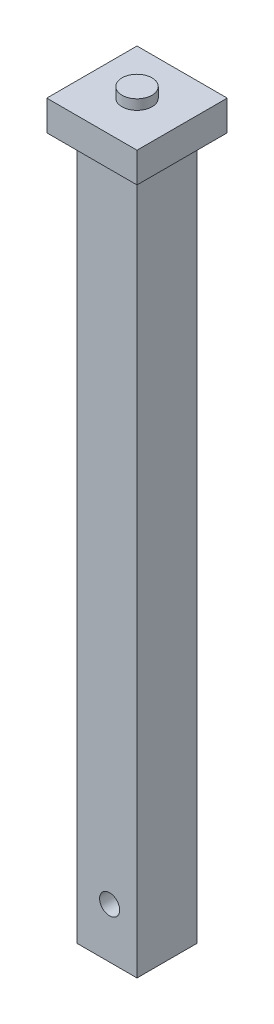
ISO-10303-21;
HEADER;
FILE_DESCRIPTION(('STEP AP214'),'2;1');
FILE_NAME('part.step','',(''),(''),'','','');
FILE_SCHEMA(('AUTOMOTIVE_DESIGN { 1 0 10303 214 1 1 1 1 }'));
ENDSEC;
DATA;
#1=APPLICATION_CONTEXT('core data for automotive mechanical design processes');
#2=APPLICATION_PROTOCOL_DEFINITION('international standard','automotive_design',2000,#1);
#3=PRODUCT_CONTEXT('',#1,'mechanical');
#4=PRODUCT('Part','Part','',(#3));
#5=PRODUCT_RELATED_PRODUCT_CATEGORY('part','',(#4));
#6=PRODUCT_DEFINITION_FORMATION('','',#4);
#7=PRODUCT_DEFINITION_CONTEXT('part definition',#1,'design');
#8=PRODUCT_DEFINITION('design','',#6,#7);
#9=PRODUCT_DEFINITION_SHAPE('','',#8);
#10=(LENGTH_UNIT() NAMED_UNIT(*) SI_UNIT(.MILLI.,.METRE.));
#11=(NAMED_UNIT(*) PLANE_ANGLE_UNIT() SI_UNIT($,.RADIAN.));
#12=(NAMED_UNIT(*) SI_UNIT($,.STERADIAN.) SOLID_ANGLE_UNIT());
#13=UNCERTAINTY_MEASURE_WITH_UNIT(LENGTH_MEASURE(1.E-05),#10,'distance_accuracy_value','');
#14=(GEOMETRIC_REPRESENTATION_CONTEXT(3) GLOBAL_UNCERTAINTY_ASSIGNED_CONTEXT((#13)) GLOBAL_UNIT_ASSIGNED_CONTEXT((#10,
#11,#12)) REPRESENTATION_CONTEXT('',''));
#15=CARTESIAN_POINT('',(0.,0.,0.));
#16=DIRECTION('',(0.,0.,1.));
#17=DIRECTION('',(1.,0.,0.));
#18=AXIS2_PLACEMENT_3D('',#15,#16,#17);
#19=CARTESIAN_POINT('',(0.,0.,0.));
#20=DIRECTION('',(0.,1.,0.));
#21=DIRECTION('',(0.,0.,1.));
#22=AXIS2_PLACEMENT_3D('',#19,#20,#21);
#23=PLANE('',#22);
#24=DIRECTION('',(0.,0.,-1.));
#25=VECTOR('',#24,1.);
#26=CARTESIAN_POINT('',(45.,0.,-45.));
#27=LINE('',#26,#25);
#28=CARTESIAN_POINT('',(45.,0.,45.));
#29=VERTEX_POINT('',#28);
#30=CARTESIAN_POINT('',(45.,0.,-45.));
#31=VERTEX_POINT('',#30);
#32=EDGE_CURVE('E132',#29,#31,#27,.T.);
#33=ORIENTED_EDGE('',*,*,#32,.F.);
#34=DIRECTION('',(1.,0.,0.));
#35=VECTOR('',#34,1.);
#36=CARTESIAN_POINT('',(-45.,0.,45.));
#37=LINE('',#36,#35);
#38=CARTESIAN_POINT('',(-45.,0.,45.));
#39=VERTEX_POINT('',#38);
#40=EDGE_CURVE('E150',#39,#29,#37,.T.);
#41=ORIENTED_EDGE('',*,*,#40,.F.);
#42=DIRECTION('',(0.,0.,1.));
#43=VECTOR('',#42,1.);
#44=CARTESIAN_POINT('',(-45.,0.,-45.));
#45=LINE('',#44,#43);
#46=CARTESIAN_POINT('',(-45.,0.,-45.));
#47=VERTEX_POINT('',#46);
#48=EDGE_CURVE('E162',#47,#39,#45,.T.);
#49=ORIENTED_EDGE('',*,*,#48,.F.);
#50=DIRECTION('',(-1.,0.,0.));
#51=VECTOR('',#50,1.);
#52=CARTESIAN_POINT('',(-45.,0.,-45.));
#53=LINE('',#52,#51);
#54=EDGE_CURVE('E138',#31,#47,#53,.T.);
#55=ORIENTED_EDGE('',*,*,#54,.F.);
#56=EDGE_LOOP('',(#33,#41,#49,#55));
#57=FACE_BOUND('',#56,.T.);
#58=DIRECTION('',(0.,0.,1.));
#59=VECTOR('',#58,1.);
#60=CARTESIAN_POINT('',(30.,0.,30.));
#61=LINE('',#60,#59);
#62=CARTESIAN_POINT('',(30.,0.,-30.));
#63=VERTEX_POINT('',#62);
#64=CARTESIAN_POINT('',(30.,0.,30.));
#65=VERTEX_POINT('',#64);
#66=EDGE_CURVE('E59',#63,#65,#61,.T.);
#67=ORIENTED_EDGE('',*,*,#66,.F.);
#68=DIRECTION('',(1.,0.,0.));
#69=VECTOR('',#68,1.);
#70=CARTESIAN_POINT('',(-30.,0.,-30.));
#71=LINE('',#70,#69);
#72=CARTESIAN_POINT('',(-30.,0.,-30.));
#73=VERTEX_POINT('',#72);
#74=EDGE_CURVE('E63',#73,#63,#71,.T.);
#75=ORIENTED_EDGE('',*,*,#74,.F.);
#76=DIRECTION('',(0.,0.,-1.));
#77=VECTOR('',#76,1.);
#78=CARTESIAN_POINT('',(-30.,0.,30.));
#79=LINE('',#78,#77);
#80=CARTESIAN_POINT('',(-30.,0.,30.));
#81=VERTEX_POINT('',#80);
#82=EDGE_CURVE('E354',#81,#73,#79,.T.);
#83=ORIENTED_EDGE('',*,*,#82,.F.);
#84=DIRECTION('',(-1.,0.,0.));
#85=VECTOR('',#84,1.);
#86=CARTESIAN_POINT('',(-30.,0.,30.));
#87=LINE('',#86,#85);
#88=EDGE_CURVE('E351',#65,#81,#87,.T.);
#89=ORIENTED_EDGE('',*,*,#88,.F.);
#90=EDGE_LOOP('',(#67,#75,#83,#89));
#91=FACE_BOUND('',#90,.T.);
#92=ADVANCED_FACE('F41',(#57,#91),#23,.F.);
#93=CARTESIAN_POINT('',(45.,30.,-45.));
#94=DIRECTION('',(-1.,0.,0.));
#95=DIRECTION('',(0.,0.,1.));
#96=AXIS2_PLACEMENT_3D('',#93,#94,#95);
#97=PLANE('',#96);
#98=ORIENTED_EDGE('',*,*,#32,.T.);
#99=DIRECTION('',(0.,-1.,0.));
#100=VECTOR('',#99,1.);
#101=CARTESIAN_POINT('',(45.,30.,-45.));
#102=LINE('',#101,#100);
#103=CARTESIAN_POINT('',(45.,30.,-45.));
#104=VERTEX_POINT('',#103);
#105=EDGE_CURVE('E51',#104,#31,#102,.T.);
#106=ORIENTED_EDGE('',*,*,#105,.F.);
#107=DIRECTION('',(0.,0.,-1.));
#108=VECTOR('',#107,1.);
#109=CARTESIAN_POINT('',(45.,30.,-45.));
#110=LINE('',#109,#108);
#111=CARTESIAN_POINT('',(45.,30.,45.));
#112=VERTEX_POINT('',#111);
#113=EDGE_CURVE('E145',#112,#104,#110,.T.);
#114=ORIENTED_EDGE('',*,*,#113,.F.);
#115=DIRECTION('',(0.,-1.,0.));
#116=VECTOR('',#115,1.);
#117=CARTESIAN_POINT('',(45.,30.,45.));
#118=LINE('',#117,#116);
#119=EDGE_CURVE('E158',#112,#29,#118,.T.);
#120=ORIENTED_EDGE('',*,*,#119,.T.);
#121=EDGE_LOOP('',(#98,#106,#114,#120));
#122=FACE_BOUND('',#121,.T.);
#123=ADVANCED_FACE('F43',(#122),#97,.F.);
#124=CARTESIAN_POINT('',(-45.,30.,-45.));
#125=DIRECTION('',(0.,0.,1.));
#126=DIRECTION('',(1.,0.,0.));
#127=AXIS2_PLACEMENT_3D('',#124,#125,#126);
#128=PLANE('',#127);
#129=ORIENTED_EDGE('',*,*,#54,.T.);
#130=DIRECTION('',(0.,-1.,0.));
#131=VECTOR('',#130,1.);
#132=CARTESIAN_POINT('',(-45.,30.,-45.));
#133=LINE('',#132,#131);
#134=CARTESIAN_POINT('',(-45.,30.,-45.));
#135=VERTEX_POINT('',#134);
#136=EDGE_CURVE('E173',#135,#47,#133,.T.);
#137=ORIENTED_EDGE('',*,*,#136,.F.);
#138=DIRECTION('',(-1.,0.,0.));
#139=VECTOR('',#138,1.);
#140=CARTESIAN_POINT('',(-45.,30.,-45.));
#141=LINE('',#140,#139);
#142=EDGE_CURVE('E149',#104,#135,#141,.T.);
#143=ORIENTED_EDGE('',*,*,#142,.F.);
#144=ORIENTED_EDGE('',*,*,#105,.T.);
#145=EDGE_LOOP('',(#129,#137,#143,#144));
#146=FACE_BOUND('',#145,.T.);
#147=ADVANCED_FACE('F179',(#146),#128,.F.);
#148=CARTESIAN_POINT('',(-45.,30.,-45.));
#149=DIRECTION('',(1.,0.,0.));
#150=DIRECTION('',(0.,0.,-1.));
#151=AXIS2_PLACEMENT_3D('',#148,#149,#150);
#152=PLANE('',#151);
#153=ORIENTED_EDGE('',*,*,#48,.T.);
#154=DIRECTION('',(0.,-1.,0.));
#155=VECTOR('',#154,1.);
#156=CARTESIAN_POINT('',(-45.,30.,45.));
#157=LINE('',#156,#155);
#158=CARTESIAN_POINT('',(-45.,30.,45.));
#159=VERTEX_POINT('',#158);
#160=EDGE_CURVE('E169',#159,#39,#157,.T.);
#161=ORIENTED_EDGE('',*,*,#160,.F.);
#162=DIRECTION('',(0.,0.,1.));
#163=VECTOR('',#162,1.);
#164=CARTESIAN_POINT('',(-45.,30.,-45.));
#165=LINE('',#164,#163);
#166=EDGE_CURVE('E153',#135,#159,#165,.T.);
#167=ORIENTED_EDGE('',*,*,#166,.F.);
#168=ORIENTED_EDGE('',*,*,#136,.T.);
#169=EDGE_LOOP('',(#153,#161,#167,#168));
#170=FACE_BOUND('',#169,.T.);
#171=ADVANCED_FACE('F190',(#170),#152,.F.);
#172=CARTESIAN_POINT('',(-45.,30.,45.));
#173=DIRECTION('',(0.,0.,-1.));
#174=DIRECTION('',(-1.,0.,0.));
#175=AXIS2_PLACEMENT_3D('',#172,#173,#174);
#176=PLANE('',#175);
#177=ORIENTED_EDGE('',*,*,#40,.T.);
#178=ORIENTED_EDGE('',*,*,#119,.F.);
#179=DIRECTION('',(1.,0.,0.));
#180=VECTOR('',#179,1.);
#181=CARTESIAN_POINT('',(-45.,30.,45.));
#182=LINE('',#181,#180);
#183=EDGE_CURVE('E156',#159,#112,#182,.T.);
#184=ORIENTED_EDGE('',*,*,#183,.F.);
#185=ORIENTED_EDGE('',*,*,#160,.T.);
#186=EDGE_LOOP('',(#177,#178,#184,#185));
#187=FACE_BOUND('',#186,.T.);
#188=ADVANCED_FACE('F194',(#187),#176,.F.);
#189=CARTESIAN_POINT('',(0.,30.,0.));
#190=DIRECTION('',(0.,1.,0.));
#191=DIRECTION('',(0.,0.,1.));
#192=AXIS2_PLACEMENT_3D('',#189,#190,#191);
#193=PLANE('',#192);
#194=CARTESIAN_POINT('',(0.,30.,0.));
#195=DIRECTION('',(0.,1.,0.));
#196=DIRECTION('',(0.,0.,1.));
#197=AXIS2_PLACEMENT_3D('',#194,#195,#196);
#198=CIRCLE('',#197,15.);
#199=CARTESIAN_POINT('',(0.,30.,15.));
#200=VERTEX_POINT('',#199);
#201=EDGE_CURVE('E11',#200,#200,#198,.T.);
#202=ORIENTED_EDGE('',*,*,#201,.F.);
#203=EDGE_LOOP('',(#202));
#204=FACE_BOUND('',#203,.T.);
#205=ORIENTED_EDGE('',*,*,#113,.T.);
#206=ORIENTED_EDGE('',*,*,#142,.T.);
#207=ORIENTED_EDGE('',*,*,#166,.T.);
#208=ORIENTED_EDGE('',*,*,#183,.T.);
#209=EDGE_LOOP('',(#205,#206,#207,#208));
#210=FACE_BOUND('',#209,.T.);
#211=ADVANCED_FACE('F196',(#204,#210),#193,.T.);
#212=CARTESIAN_POINT('',(30.,-700.,30.));
#213=DIRECTION('',(-1.,0.,0.));
#214=DIRECTION('',(0.,0.,1.));
#215=AXIS2_PLACEMENT_3D('',#212,#213,#214);
#216=PLANE('',#215);
#217=ORIENTED_EDGE('',*,*,#66,.T.);
#218=DIRECTION('',(0.,1.,0.));
#219=VECTOR('',#218,1.);
#220=CARTESIAN_POINT('',(30.,-700.,30.));
#221=LINE('',#220,#219);
#222=CARTESIAN_POINT('',(30.,-700.,30.));
#223=VERTEX_POINT('',#222);
#224=EDGE_CURVE('E112',#223,#65,#221,.T.);
#225=ORIENTED_EDGE('',*,*,#224,.F.);
#226=DIRECTION('',(0.,0.,1.));
#227=VECTOR('',#226,1.);
#228=CARTESIAN_POINT('',(30.,-700.,30.));
#229=LINE('',#228,#227);
#230=CARTESIAN_POINT('',(30.,-700.,-30.));
#231=VERTEX_POINT('',#230);
#232=EDGE_CURVE('E119',#231,#223,#229,.T.);
#233=ORIENTED_EDGE('',*,*,#232,.F.);
#234=DIRECTION('',(0.,1.,0.));
#235=VECTOR('',#234,1.);
#236=CARTESIAN_POINT('',(30.,-700.,-30.));
#237=LINE('',#236,#235);
#238=EDGE_CURVE('E348',#231,#63,#237,.T.);
#239=ORIENTED_EDGE('',*,*,#238,.T.);
#240=EDGE_LOOP('',(#217,#225,#233,#239));
#241=FACE_BOUND('',#240,.T.);
#242=ADVANCED_FACE('F130',(#241),#216,.F.);
#243=CARTESIAN_POINT('',(-30.,-700.,30.));
#244=DIRECTION('',(0.,0.,-1.));
#245=DIRECTION('',(-1.,0.,0.));
#246=AXIS2_PLACEMENT_3D('',#243,#244,#245);
#247=PLANE('',#246);
#248=CARTESIAN_POINT('',(2.69294420007926,-650.,30.));
#249=DIRECTION('',(0.,0.,1.));
#250=DIRECTION('',(1.,0.,0.));
#251=AXIS2_PLACEMENT_3D('',#248,#249,#250);
#252=CIRCLE('',#251,10.);
#253=CARTESIAN_POINT('',(12.6929442000793,-650.,30.));
#254=VERTEX_POINT('',#253);
#255=EDGE_CURVE('E338',#254,#254,#252,.T.);
#256=ORIENTED_EDGE('',*,*,#255,.F.);
#257=EDGE_LOOP('',(#256));
#258=FACE_BOUND('',#257,.T.);
#259=ORIENTED_EDGE('',*,*,#88,.T.);
#260=DIRECTION('',(0.,1.,0.));
#261=VECTOR('',#260,1.);
#262=CARTESIAN_POINT('',(-30.,-700.,30.));
#263=LINE('',#262,#261);
#264=CARTESIAN_POINT('',(-30.,-700.,30.));
#265=VERTEX_POINT('',#264);
#266=EDGE_CURVE('E114',#265,#81,#263,.T.);
#267=ORIENTED_EDGE('',*,*,#266,.F.);
#268=DIRECTION('',(-1.,0.,0.));
#269=VECTOR('',#268,1.);
#270=CARTESIAN_POINT('',(-30.,-700.,30.));
#271=LINE('',#270,#269);
#272=EDGE_CURVE('E107',#223,#265,#271,.T.);
#273=ORIENTED_EDGE('',*,*,#272,.F.);
#274=ORIENTED_EDGE('',*,*,#224,.T.);
#275=EDGE_LOOP('',(#259,#267,#273,#274));
#276=FACE_BOUND('',#275,.T.);
#277=ADVANCED_FACE('F110',(#258,#276),#247,.F.);
#278=CARTESIAN_POINT('',(-30.,-700.,30.));
#279=DIRECTION('',(1.,0.,0.));
#280=DIRECTION('',(0.,0.,-1.));
#281=AXIS2_PLACEMENT_3D('',#278,#279,#280);
#282=PLANE('',#281);
#283=ORIENTED_EDGE('',*,*,#82,.T.);
#284=DIRECTION('',(0.,1.,0.));
#285=VECTOR('',#284,1.);
#286=CARTESIAN_POINT('',(-30.,-700.,-30.));
#287=LINE('',#286,#285);
#288=CARTESIAN_POINT('',(-30.,-700.,-30.));
#289=VERTEX_POINT('',#288);
#290=EDGE_CURVE('E141',#289,#73,#287,.T.);
#291=ORIENTED_EDGE('',*,*,#290,.F.);
#292=DIRECTION('',(0.,0.,-1.));
#293=VECTOR('',#292,1.);
#294=CARTESIAN_POINT('',(-30.,-700.,30.));
#295=LINE('',#294,#293);
#296=EDGE_CURVE('E118',#265,#289,#295,.T.);
#297=ORIENTED_EDGE('',*,*,#296,.F.);
#298=ORIENTED_EDGE('',*,*,#266,.T.);
#299=EDGE_LOOP('',(#283,#291,#297,#298));
#300=FACE_BOUND('',#299,.T.);
#301=ADVANCED_FACE('F244',(#300),#282,.F.);
#302=CARTESIAN_POINT('',(-30.,-700.,-30.));
#303=DIRECTION('',(0.,0.,1.));
#304=DIRECTION('',(1.,0.,0.));
#305=AXIS2_PLACEMENT_3D('',#302,#303,#304);
#306=PLANE('',#305);
#307=CARTESIAN_POINT('',(2.69294420007926,-650.,-30.));
#308=DIRECTION('',(0.,0.,1.));
#309=DIRECTION('',(1.,0.,0.));
#310=AXIS2_PLACEMENT_3D('',#307,#308,#309);
#311=CIRCLE('',#310,10.);
#312=CARTESIAN_POINT('',(12.6929442000793,-650.,-30.));
#313=VERTEX_POINT('',#312);
#314=EDGE_CURVE('E45',#313,#313,#311,.T.);
#315=ORIENTED_EDGE('',*,*,#314,.T.);
#316=EDGE_LOOP('',(#315));
#317=FACE_BOUND('',#316,.T.);
#318=ORIENTED_EDGE('',*,*,#74,.T.);
#319=ORIENTED_EDGE('',*,*,#238,.F.);
#320=DIRECTION('',(1.,0.,0.));
#321=VECTOR('',#320,1.);
#322=CARTESIAN_POINT('',(-30.,-700.,-30.));
#323=LINE('',#322,#321);
#324=EDGE_CURVE('E124',#289,#231,#323,.T.);
#325=ORIENTED_EDGE('',*,*,#324,.F.);
#326=ORIENTED_EDGE('',*,*,#290,.T.);
#327=EDGE_LOOP('',(#318,#319,#325,#326));
#328=FACE_BOUND('',#327,.T.);
#329=ADVANCED_FACE('F254',(#317,#328),#306,.F.);
#330=CARTESIAN_POINT('',(0.,-700.,0.));
#331=DIRECTION('',(0.,-1.,0.));
#332=DIRECTION('',(0.,0.,-1.));
#333=AXIS2_PLACEMENT_3D('',#330,#331,#332);
#334=PLANE('',#333);
#335=ORIENTED_EDGE('',*,*,#232,.T.);
#336=ORIENTED_EDGE('',*,*,#272,.T.);
#337=ORIENTED_EDGE('',*,*,#296,.T.);
#338=ORIENTED_EDGE('',*,*,#324,.T.);
#339=EDGE_LOOP('',(#335,#336,#337,#338));
#340=FACE_BOUND('',#339,.T.);
#341=ADVANCED_FACE('F122',(#340),#334,.T.);
#342=CARTESIAN_POINT('',(2.69294420007926,-650.,-45.));
#343=DIRECTION('',(0.,0.,1.));
#344=DIRECTION('',(1.,0.,0.));
#345=AXIS2_PLACEMENT_3D('',#342,#343,#344);
#346=CYLINDRICAL_SURFACE('',#345,10.);
#347=ORIENTED_EDGE('',*,*,#255,.T.);
#348=EDGE_LOOP('',(#347));
#349=FACE_BOUND('',#348,.T.);
#350=ORIENTED_EDGE('',*,*,#314,.F.);
#351=EDGE_LOOP('',(#350));
#352=FACE_BOUND('',#351,.T.);
#353=ADVANCED_FACE('F269',(#349,#352),#346,.F.);
#354=CARTESIAN_POINT('',(0.,40.,0.));
#355=DIRECTION('',(0.,-1.,0.));
#356=DIRECTION('',(0.,0.,-1.));
#357=AXIS2_PLACEMENT_3D('',#354,#355,#356);
#358=CYLINDRICAL_SURFACE('',#357,15.);
#359=CARTESIAN_POINT('',(0.,40.,0.));
#360=DIRECTION('',(0.,1.,0.));
#361=DIRECTION('',(0.,0.,1.));
#362=AXIS2_PLACEMENT_3D('',#359,#360,#361);
#363=CIRCLE('',#362,15.);
#364=CARTESIAN_POINT('',(0.,40.,15.));
#365=VERTEX_POINT('',#364);
#366=EDGE_CURVE('E336',#365,#365,#363,.T.);
#367=ORIENTED_EDGE('',*,*,#366,.F.);
#368=EDGE_LOOP('',(#367));
#369=FACE_BOUND('',#368,.T.);
#370=ORIENTED_EDGE('',*,*,#201,.T.);
#371=EDGE_LOOP('',(#370));
#372=FACE_BOUND('',#371,.T.);
#373=ADVANCED_FACE('F276',(#369,#372),#358,.T.);
#374=CARTESIAN_POINT('',(0.,40.,0.));
#375=DIRECTION('',(0.,1.,0.));
#376=DIRECTION('',(0.,0.,1.));
#377=AXIS2_PLACEMENT_3D('',#374,#375,#376);
#378=PLANE('',#377);
#379=ORIENTED_EDGE('',*,*,#366,.T.);
#380=EDGE_LOOP('',(#379));
#381=FACE_BOUND('',#380,.T.);
#382=ADVANCED_FACE('F284',(#381),#378,.T.);
#383=CLOSED_SHELL('',(#92,#123,#147,#171,#188,#211,#242,#277,#301,#329,#341,#353,#373,#382));
#384=MANIFOLD_SOLID_BREP('B2',#383);
#385=ADVANCED_BREP_SHAPE_REPRESENTATION('',(#18,#384),#14);
#386=SHAPE_DEFINITION_REPRESENTATION(#9,#385);
ENDSEC;
END-ISO-10303-21;
